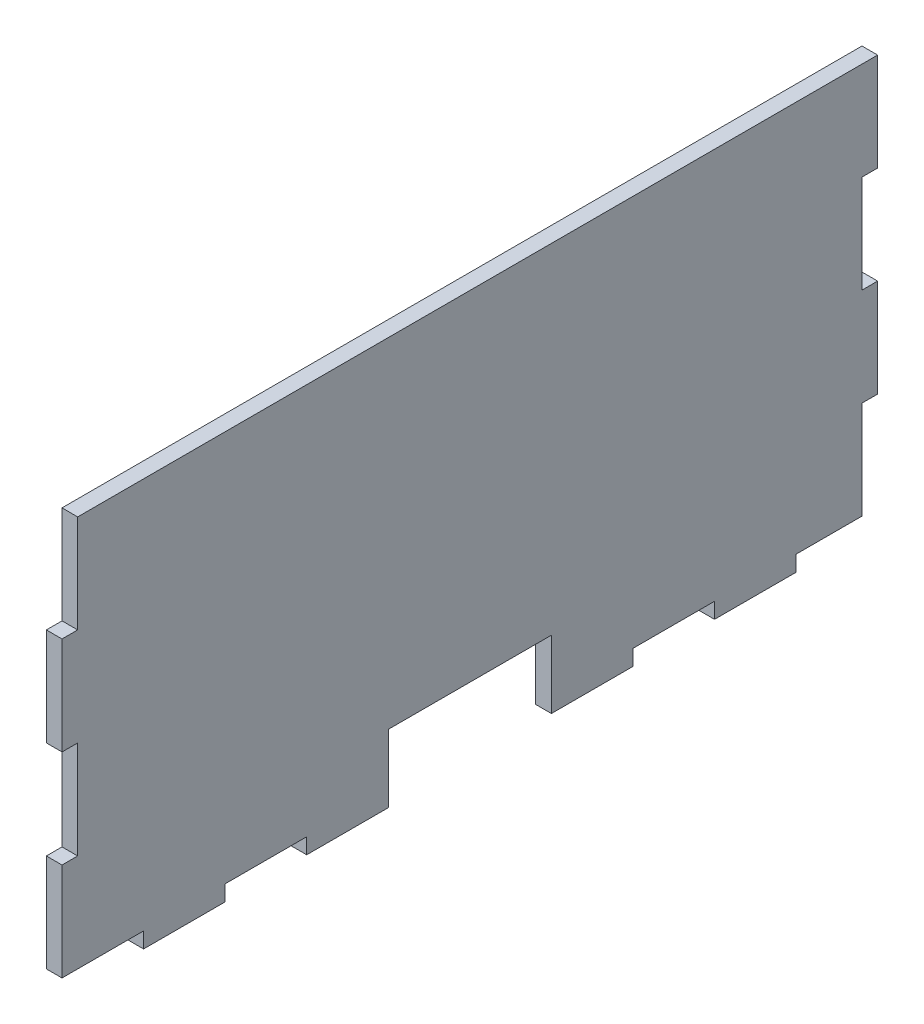
ISO-10303-21;
HEADER;
FILE_DESCRIPTION(('STEP AP214'),'2;1');
FILE_NAME('part.step','',(''),(''),'','','');
FILE_SCHEMA(('AUTOMOTIVE_DESIGN { 1 0 10303 214 1 1 1 1 }'));
ENDSEC;
DATA;
#1=APPLICATION_CONTEXT('core data for automotive mechanical design processes');
#2=APPLICATION_PROTOCOL_DEFINITION('international standard','automotive_design',2000,#1);
#3=PRODUCT_CONTEXT('',#1,'mechanical');
#4=PRODUCT('Part','Part','',(#3));
#5=PRODUCT_RELATED_PRODUCT_CATEGORY('part','',(#4));
#6=PRODUCT_DEFINITION_FORMATION('','',#4);
#7=PRODUCT_DEFINITION_CONTEXT('part definition',#1,'design');
#8=PRODUCT_DEFINITION('design','',#6,#7);
#9=PRODUCT_DEFINITION_SHAPE('','',#8);
#10=(LENGTH_UNIT() NAMED_UNIT(*) SI_UNIT(.MILLI.,.METRE.));
#11=(NAMED_UNIT(*) PLANE_ANGLE_UNIT() SI_UNIT($,.RADIAN.));
#12=(NAMED_UNIT(*) SI_UNIT($,.STERADIAN.) SOLID_ANGLE_UNIT());
#13=UNCERTAINTY_MEASURE_WITH_UNIT(LENGTH_MEASURE(1.E-05),#10,'distance_accuracy_value','');
#14=(GEOMETRIC_REPRESENTATION_CONTEXT(3) GLOBAL_UNCERTAINTY_ASSIGNED_CONTEXT((#13)) GLOBAL_UNIT_ASSIGNED_CONTEXT((#10,
#11,#12)) REPRESENTATION_CONTEXT('',''));
#15=CARTESIAN_POINT('',(0.,0.,0.));
#16=DIRECTION('',(0.,0.,1.));
#17=DIRECTION('',(1.,0.,0.));
#18=AXIS2_PLACEMENT_3D('',#15,#16,#17);
#19=CARTESIAN_POINT('',(3.048,79.248,-3.04799999999998));
#20=DIRECTION('',(0.,0.,-1.));
#21=DIRECTION('',(0.,1.,0.));
#22=AXIS2_PLACEMENT_3D('',#19,#20,#21);
#23=PLANE('',#22);
#24=DIRECTION('',(0.,-1.,0.));
#25=VECTOR('',#24,1.);
#26=CARTESIAN_POINT('',(0.,79.248,-3.04799999999998));
#27=LINE('',#26,#25);
#28=CARTESIAN_POINT('',(0.,79.248,-3.04799999999998));
#29=VERTEX_POINT('',#28);
#30=CARTESIAN_POINT('',(0.,60.198,-3.04799999999998));
#31=VERTEX_POINT('',#30);
#32=EDGE_CURVE('E272',#29,#31,#27,.T.);
#33=ORIENTED_EDGE('',*,*,#32,.T.);
#34=DIRECTION('',(-1.,0.,0.));
#35=VECTOR('',#34,1.);
#36=CARTESIAN_POINT('',(3.048,60.198,-3.04799999999998));
#37=LINE('',#36,#35);
#38=CARTESIAN_POINT('',(3.048,60.198,-3.04799999999998));
#39=VERTEX_POINT('',#38);
#40=EDGE_CURVE('E11',#39,#31,#37,.T.);
#41=ORIENTED_EDGE('',*,*,#40,.F.);
#42=DIRECTION('',(0.,-1.,0.));
#43=VECTOR('',#42,1.);
#44=CARTESIAN_POINT('',(3.048,79.248,-3.04799999999998));
#45=LINE('',#44,#43);
#46=CARTESIAN_POINT('',(3.048,79.248,-3.04799999999998));
#47=VERTEX_POINT('',#46);
#48=EDGE_CURVE('E336',#47,#39,#45,.T.);
#49=ORIENTED_EDGE('',*,*,#48,.F.);
#50=DIRECTION('',(-1.,0.,0.));
#51=VECTOR('',#50,1.);
#52=CARTESIAN_POINT('',(3.048,79.248,-3.04799999999998));
#53=LINE('',#52,#51);
#54=EDGE_CURVE('E268',#47,#29,#53,.T.);
#55=ORIENTED_EDGE('',*,*,#54,.T.);
#56=EDGE_LOOP('',(#33,#41,#49,#55));
#57=FACE_BOUND('',#56,.T.);
#58=ADVANCED_FACE('F32',(#57),#23,.F.);
#59=CARTESIAN_POINT('',(3.048,60.198,-3.04799999999998));
#60=DIRECTION('',(0.,-1.,0.));
#61=DIRECTION('',(0.,0.,-1.));
#62=AXIS2_PLACEMENT_3D('',#59,#60,#61);
#63=PLANE('',#62);
#64=DIRECTION('',(0.,0.,1.));
#65=VECTOR('',#64,1.);
#66=CARTESIAN_POINT('',(0.,60.198,-3.04799999999998));
#67=LINE('',#66,#65);
#68=CARTESIAN_POINT('',(0.,60.198,0.));
#69=VERTEX_POINT('',#68);
#70=EDGE_CURVE('E275',#31,#69,#67,.T.);
#71=ORIENTED_EDGE('',*,*,#70,.T.);
#72=DIRECTION('',(-1.,0.,0.));
#73=VECTOR('',#72,1.);
#74=CARTESIAN_POINT('',(3.048,60.198,0.));
#75=LINE('',#74,#73);
#76=CARTESIAN_POINT('',(3.048,60.198,0.));
#77=VERTEX_POINT('',#76);
#78=EDGE_CURVE('E40',#77,#69,#75,.T.);
#79=ORIENTED_EDGE('',*,*,#78,.F.);
#80=DIRECTION('',(0.,0.,1.));
#81=VECTOR('',#80,1.);
#82=CARTESIAN_POINT('',(3.048,60.198,-3.04799999999998));
#83=LINE('',#82,#81);
#84=EDGE_CURVE('E163',#39,#77,#83,.T.);
#85=ORIENTED_EDGE('',*,*,#84,.F.);
#86=ORIENTED_EDGE('',*,*,#40,.T.);
#87=EDGE_LOOP('',(#71,#79,#85,#86));
#88=FACE_BOUND('',#87,.T.);
#89=ADVANCED_FACE('F514',(#88),#63,.F.);
#90=CARTESIAN_POINT('',(3.048,60.198,0.));
#91=DIRECTION('',(0.,0.,-1.));
#92=DIRECTION('',(0.,1.,0.));
#93=AXIS2_PLACEMENT_3D('',#90,#91,#92);
#94=PLANE('',#93);
#95=DIRECTION('',(0.,-1.,0.));
#96=VECTOR('',#95,1.);
#97=CARTESIAN_POINT('',(0.,60.198,0.));
#98=LINE('',#97,#96);
#99=CARTESIAN_POINT('',(0.,41.148,0.));
#100=VERTEX_POINT('',#99);
#101=EDGE_CURVE('E277',#69,#100,#98,.T.);
#102=ORIENTED_EDGE('',*,*,#101,.T.);
#103=DIRECTION('',(-1.,0.,0.));
#104=VECTOR('',#103,1.);
#105=CARTESIAN_POINT('',(3.048,41.148,0.));
#106=LINE('',#105,#104);
#107=CARTESIAN_POINT('',(3.048,41.148,0.));
#108=VERTEX_POINT('',#107);
#109=EDGE_CURVE('E415',#108,#100,#106,.T.);
#110=ORIENTED_EDGE('',*,*,#109,.F.);
#111=DIRECTION('',(0.,-1.,0.));
#112=VECTOR('',#111,1.);
#113=CARTESIAN_POINT('',(3.048,60.198,0.));
#114=LINE('',#113,#112);
#115=EDGE_CURVE('E423',#77,#108,#114,.T.);
#116=ORIENTED_EDGE('',*,*,#115,.F.);
#117=ORIENTED_EDGE('',*,*,#78,.T.);
#118=EDGE_LOOP('',(#102,#110,#116,#117));
#119=FACE_BOUND('',#118,.T.);
#120=ADVANCED_FACE('F421',(#119),#94,.F.);
#121=CARTESIAN_POINT('',(3.048,41.148,0.));
#122=DIRECTION('',(0.,1.,0.));
#123=DIRECTION('',(0.,0.,1.));
#124=AXIS2_PLACEMENT_3D('',#121,#122,#123);
#125=PLANE('',#124);
#126=DIRECTION('',(0.,0.,-1.));
#127=VECTOR('',#126,1.);
#128=CARTESIAN_POINT('',(0.,41.148,0.));
#129=LINE('',#128,#127);
#130=CARTESIAN_POINT('',(0.,41.148,-3.04799999999999));
#131=VERTEX_POINT('',#130);
#132=EDGE_CURVE('E279',#100,#131,#129,.T.);
#133=ORIENTED_EDGE('',*,*,#132,.T.);
#134=DIRECTION('',(-1.,0.,0.));
#135=VECTOR('',#134,1.);
#136=CARTESIAN_POINT('',(3.048,41.148,-3.04799999999999));
#137=LINE('',#136,#135);
#138=CARTESIAN_POINT('',(3.048,41.148,-3.04799999999999));
#139=VERTEX_POINT('',#138);
#140=EDGE_CURVE('E412',#139,#131,#137,.T.);
#141=ORIENTED_EDGE('',*,*,#140,.F.);
#142=DIRECTION('',(0.,0.,-1.));
#143=VECTOR('',#142,1.);
#144=CARTESIAN_POINT('',(3.048,41.148,0.));
#145=LINE('',#144,#143);
#146=EDGE_CURVE('E441',#108,#139,#145,.T.);
#147=ORIENTED_EDGE('',*,*,#146,.F.);
#148=ORIENTED_EDGE('',*,*,#109,.T.);
#149=EDGE_LOOP('',(#133,#141,#147,#148));
#150=FACE_BOUND('',#149,.T.);
#151=ADVANCED_FACE('F432',(#150),#125,.F.);
#152=CARTESIAN_POINT('',(3.048,41.148,-3.04799999999999));
#153=DIRECTION('',(0.,0.,-1.));
#154=DIRECTION('',(0.,1.,0.));
#155=AXIS2_PLACEMENT_3D('',#152,#153,#154);
#156=PLANE('',#155);
#157=DIRECTION('',(0.,-1.,0.));
#158=VECTOR('',#157,1.);
#159=CARTESIAN_POINT('',(0.,41.148,-3.04799999999999));
#160=LINE('',#159,#158);
#161=CARTESIAN_POINT('',(0.,22.098,-3.04799999999999));
#162=VERTEX_POINT('',#161);
#163=EDGE_CURVE('E281',#131,#162,#160,.T.);
#164=ORIENTED_EDGE('',*,*,#163,.T.);
#165=DIRECTION('',(-1.,0.,0.));
#166=VECTOR('',#165,1.);
#167=CARTESIAN_POINT('',(3.048,22.098,-3.04799999999999));
#168=LINE('',#167,#166);
#169=CARTESIAN_POINT('',(3.048,22.098,-3.04799999999999));
#170=VERTEX_POINT('',#169);
#171=EDGE_CURVE('E409',#170,#162,#168,.T.);
#172=ORIENTED_EDGE('',*,*,#171,.F.);
#173=DIRECTION('',(0.,-1.,0.));
#174=VECTOR('',#173,1.);
#175=CARTESIAN_POINT('',(3.048,41.148,-3.04799999999999));
#176=LINE('',#175,#174);
#177=EDGE_CURVE('E438',#139,#170,#176,.T.);
#178=ORIENTED_EDGE('',*,*,#177,.F.);
#179=ORIENTED_EDGE('',*,*,#140,.T.);
#180=EDGE_LOOP('',(#164,#172,#178,#179));
#181=FACE_BOUND('',#180,.T.);
#182=ADVANCED_FACE('F436',(#181),#156,.F.);
#183=CARTESIAN_POINT('',(3.048,22.098,-3.04799999999999));
#184=DIRECTION('',(0.,-1.,0.));
#185=DIRECTION('',(0.,0.,-1.));
#186=AXIS2_PLACEMENT_3D('',#183,#184,#185);
#187=PLANE('',#186);
#188=DIRECTION('',(0.,0.,1.));
#189=VECTOR('',#188,1.);
#190=CARTESIAN_POINT('',(0.,22.098,-3.04799999999999));
#191=LINE('',#190,#189);
#192=CARTESIAN_POINT('',(0.,22.098,0.));
#193=VERTEX_POINT('',#192);
#194=EDGE_CURVE('E283',#162,#193,#191,.T.);
#195=ORIENTED_EDGE('',*,*,#194,.T.);
#196=DIRECTION('',(-1.,0.,0.));
#197=VECTOR('',#196,1.);
#198=CARTESIAN_POINT('',(3.048,22.098,0.));
#199=LINE('',#198,#197);
#200=CARTESIAN_POINT('',(3.048,22.098,0.));
#201=VERTEX_POINT('',#200);
#202=EDGE_CURVE('E406',#201,#193,#199,.T.);
#203=ORIENTED_EDGE('',*,*,#202,.F.);
#204=DIRECTION('',(0.,0.,1.));
#205=VECTOR('',#204,1.);
#206=CARTESIAN_POINT('',(3.048,22.098,-3.04799999999999));
#207=LINE('',#206,#205);
#208=EDGE_CURVE('E440',#170,#201,#207,.T.);
#209=ORIENTED_EDGE('',*,*,#208,.F.);
#210=ORIENTED_EDGE('',*,*,#171,.T.);
#211=EDGE_LOOP('',(#195,#203,#209,#210));
#212=FACE_BOUND('',#211,.T.);
#213=ADVANCED_FACE('F527',(#212),#187,.F.);
#214=CARTESIAN_POINT('',(3.048,22.098,0.));
#215=DIRECTION('',(0.,0.,-1.));
#216=DIRECTION('',(0.,1.,0.));
#217=AXIS2_PLACEMENT_3D('',#214,#215,#216);
#218=PLANE('',#217);
#219=DIRECTION('',(0.,-1.,0.));
#220=VECTOR('',#219,1.);
#221=CARTESIAN_POINT('',(0.,22.098,0.));
#222=LINE('',#221,#220);
#223=CARTESIAN_POINT('',(0.,3.048,0.));
#224=VERTEX_POINT('',#223);
#225=EDGE_CURVE('E285',#193,#224,#222,.T.);
#226=ORIENTED_EDGE('',*,*,#225,.T.);
#227=DIRECTION('',(-1.,0.,0.));
#228=VECTOR('',#227,1.);
#229=CARTESIAN_POINT('',(3.048,3.048,0.));
#230=LINE('',#229,#228);
#231=CARTESIAN_POINT('',(3.048,3.048,0.));
#232=VERTEX_POINT('',#231);
#233=EDGE_CURVE('E403',#232,#224,#230,.T.);
#234=ORIENTED_EDGE('',*,*,#233,.F.);
#235=DIRECTION('',(0.,-1.,0.));
#236=VECTOR('',#235,1.);
#237=CARTESIAN_POINT('',(3.048,22.098,0.));
#238=LINE('',#237,#236);
#239=EDGE_CURVE('E443',#201,#232,#238,.T.);
#240=ORIENTED_EDGE('',*,*,#239,.F.);
#241=ORIENTED_EDGE('',*,*,#202,.T.);
#242=EDGE_LOOP('',(#226,#234,#240,#241));
#243=FACE_BOUND('',#242,.T.);
#244=ADVANCED_FACE('F530',(#243),#218,.F.);
#245=CARTESIAN_POINT('',(3.048,3.048,0.));
#246=DIRECTION('',(0.,1.,0.));
#247=DIRECTION('',(0.,0.,1.));
#248=AXIS2_PLACEMENT_3D('',#245,#246,#247);
#249=PLANE('',#248);
#250=DIRECTION('',(0.,0.,-1.));
#251=VECTOR('',#250,1.);
#252=CARTESIAN_POINT('',(0.,3.048,0.));
#253=LINE('',#252,#251);
#254=CARTESIAN_POINT('',(0.,3.048,-15.875));
#255=VERTEX_POINT('',#254);
#256=EDGE_CURVE('E287',#224,#255,#253,.T.);
#257=ORIENTED_EDGE('',*,*,#256,.T.);
#258=DIRECTION('',(-1.,0.,0.));
#259=VECTOR('',#258,1.);
#260=CARTESIAN_POINT('',(3.048,3.048,-15.875));
#261=LINE('',#260,#259);
#262=CARTESIAN_POINT('',(3.048,3.048,-15.875));
#263=VERTEX_POINT('',#262);
#264=EDGE_CURVE('E400',#263,#255,#261,.T.);
#265=ORIENTED_EDGE('',*,*,#264,.F.);
#266=DIRECTION('',(0.,0.,-1.));
#267=VECTOR('',#266,1.);
#268=CARTESIAN_POINT('',(3.048,3.048,0.));
#269=LINE('',#268,#267);
#270=EDGE_CURVE('E449',#232,#263,#269,.T.);
#271=ORIENTED_EDGE('',*,*,#270,.F.);
#272=ORIENTED_EDGE('',*,*,#233,.T.);
#273=EDGE_LOOP('',(#257,#265,#271,#272));
#274=FACE_BOUND('',#273,.T.);
#275=ADVANCED_FACE('F534',(#274),#249,.F.);
#276=CARTESIAN_POINT('',(3.048,3.048,-15.875));
#277=DIRECTION('',(0.,0.,-1.));
#278=DIRECTION('',(0.,1.,0.));
#279=AXIS2_PLACEMENT_3D('',#276,#277,#278);
#280=PLANE('',#279);
#281=DIRECTION('',(0.,-1.,0.));
#282=VECTOR('',#281,1.);
#283=CARTESIAN_POINT('',(0.,3.048,-15.875));
#284=LINE('',#283,#282);
#285=CARTESIAN_POINT('',(0.,0.,-15.875));
#286=VERTEX_POINT('',#285);
#287=EDGE_CURVE('E289',#255,#286,#284,.T.);
#288=ORIENTED_EDGE('',*,*,#287,.T.);
#289=DIRECTION('',(-1.,0.,0.));
#290=VECTOR('',#289,1.);
#291=CARTESIAN_POINT('',(3.048,0.,-15.875));
#292=LINE('',#291,#290);
#293=CARTESIAN_POINT('',(3.048,0.,-15.875));
#294=VERTEX_POINT('',#293);
#295=EDGE_CURVE('E397',#294,#286,#292,.T.);
#296=ORIENTED_EDGE('',*,*,#295,.F.);
#297=DIRECTION('',(0.,-1.,0.));
#298=VECTOR('',#297,1.);
#299=CARTESIAN_POINT('',(3.048,3.048,-15.875));
#300=LINE('',#299,#298);
#301=EDGE_CURVE('E451',#263,#294,#300,.T.);
#302=ORIENTED_EDGE('',*,*,#301,.F.);
#303=ORIENTED_EDGE('',*,*,#264,.T.);
#304=EDGE_LOOP('',(#288,#296,#302,#303));
#305=FACE_BOUND('',#304,.T.);
#306=ADVANCED_FACE('F538',(#305),#280,.F.);
#307=CARTESIAN_POINT('',(3.048,0.,-15.875));
#308=DIRECTION('',(0.,1.,0.));
#309=DIRECTION('',(0.,0.,1.));
#310=AXIS2_PLACEMENT_3D('',#307,#308,#309);
#311=PLANE('',#310);
#312=DIRECTION('',(0.,0.,-1.));
#313=VECTOR('',#312,1.);
#314=CARTESIAN_POINT('',(0.,0.,-15.875));
#315=LINE('',#314,#313);
#316=CARTESIAN_POINT('',(0.,0.,-31.75));
#317=VERTEX_POINT('',#316);
#318=EDGE_CURVE('E291',#286,#317,#315,.T.);
#319=ORIENTED_EDGE('',*,*,#318,.T.);
#320=DIRECTION('',(-1.,0.,0.));
#321=VECTOR('',#320,1.);
#322=CARTESIAN_POINT('',(3.048,0.,-31.75));
#323=LINE('',#322,#321);
#324=CARTESIAN_POINT('',(3.048,0.,-31.75));
#325=VERTEX_POINT('',#324);
#326=EDGE_CURVE('E394',#325,#317,#323,.T.);
#327=ORIENTED_EDGE('',*,*,#326,.F.);
#328=DIRECTION('',(0.,0.,-1.));
#329=VECTOR('',#328,1.);
#330=CARTESIAN_POINT('',(3.048,0.,-15.875));
#331=LINE('',#330,#329);
#332=EDGE_CURVE('E453',#294,#325,#331,.T.);
#333=ORIENTED_EDGE('',*,*,#332,.F.);
#334=ORIENTED_EDGE('',*,*,#295,.T.);
#335=EDGE_LOOP('',(#319,#327,#333,#334));
#336=FACE_BOUND('',#335,.T.);
#337=ADVANCED_FACE('F542',(#336),#311,.F.);
#338=CARTESIAN_POINT('',(3.048,0.,-31.75));
#339=DIRECTION('',(0.,0.,1.));
#340=DIRECTION('',(1.,0.,0.));
#341=AXIS2_PLACEMENT_3D('',#338,#339,#340);
#342=PLANE('',#341);
#343=DIRECTION('',(0.,1.,0.));
#344=VECTOR('',#343,1.);
#345=CARTESIAN_POINT('',(0.,0.,-31.75));
#346=LINE('',#345,#344);
#347=CARTESIAN_POINT('',(0.,3.048,-31.75));
#348=VERTEX_POINT('',#347);
#349=EDGE_CURVE('E293',#317,#348,#346,.T.);
#350=ORIENTED_EDGE('',*,*,#349,.T.);
#351=DIRECTION('',(-1.,0.,0.));
#352=VECTOR('',#351,1.);
#353=CARTESIAN_POINT('',(3.048,3.048,-31.75));
#354=LINE('',#353,#352);
#355=CARTESIAN_POINT('',(3.048,3.048,-31.75));
#356=VERTEX_POINT('',#355);
#357=EDGE_CURVE('E391',#356,#348,#354,.T.);
#358=ORIENTED_EDGE('',*,*,#357,.F.);
#359=DIRECTION('',(0.,1.,0.));
#360=VECTOR('',#359,1.);
#361=CARTESIAN_POINT('',(3.048,0.,-31.75));
#362=LINE('',#361,#360);
#363=EDGE_CURVE('E455',#325,#356,#362,.T.);
#364=ORIENTED_EDGE('',*,*,#363,.F.);
#365=ORIENTED_EDGE('',*,*,#326,.T.);
#366=EDGE_LOOP('',(#350,#358,#364,#365));
#367=FACE_BOUND('',#366,.T.);
#368=ADVANCED_FACE('F546',(#367),#342,.F.);
#369=CARTESIAN_POINT('',(3.048,3.048,-31.75));
#370=DIRECTION('',(0.,1.,0.));
#371=DIRECTION('',(0.,0.,1.));
#372=AXIS2_PLACEMENT_3D('',#369,#370,#371);
#373=PLANE('',#372);
#374=DIRECTION('',(0.,0.,-1.));
#375=VECTOR('',#374,1.);
#376=CARTESIAN_POINT('',(0.,3.048,-31.75));
#377=LINE('',#376,#375);
#378=CARTESIAN_POINT('',(0.,3.048,-47.625));
#379=VERTEX_POINT('',#378);
#380=EDGE_CURVE('E295',#348,#379,#377,.T.);
#381=ORIENTED_EDGE('',*,*,#380,.T.);
#382=DIRECTION('',(-1.,0.,0.));
#383=VECTOR('',#382,1.);
#384=CARTESIAN_POINT('',(3.048,3.048,-47.625));
#385=LINE('',#384,#383);
#386=CARTESIAN_POINT('',(3.048,3.048,-47.625));
#387=VERTEX_POINT('',#386);
#388=EDGE_CURVE('E388',#387,#379,#385,.T.);
#389=ORIENTED_EDGE('',*,*,#388,.F.);
#390=DIRECTION('',(0.,0.,-1.));
#391=VECTOR('',#390,1.);
#392=CARTESIAN_POINT('',(3.048,3.048,-31.75));
#393=LINE('',#392,#391);
#394=EDGE_CURVE('E457',#356,#387,#393,.T.);
#395=ORIENTED_EDGE('',*,*,#394,.F.);
#396=ORIENTED_EDGE('',*,*,#357,.T.);
#397=EDGE_LOOP('',(#381,#389,#395,#396));
#398=FACE_BOUND('',#397,.T.);
#399=ADVANCED_FACE('F550',(#398),#373,.F.);
#400=CARTESIAN_POINT('',(3.048,3.048,-47.625));
#401=DIRECTION('',(0.,0.,-1.));
#402=DIRECTION('',(-1.,0.,0.));
#403=AXIS2_PLACEMENT_3D('',#400,#401,#402);
#404=PLANE('',#403);
#405=DIRECTION('',(0.,-1.,0.));
#406=VECTOR('',#405,1.);
#407=CARTESIAN_POINT('',(0.,3.048,-47.625));
#408=LINE('',#407,#406);
#409=CARTESIAN_POINT('',(0.,0.,-47.625));
#410=VERTEX_POINT('',#409);
#411=EDGE_CURVE('E297',#379,#410,#408,.T.);
#412=ORIENTED_EDGE('',*,*,#411,.T.);
#413=DIRECTION('',(-1.,0.,0.));
#414=VECTOR('',#413,1.);
#415=CARTESIAN_POINT('',(3.048,0.,-47.625));
#416=LINE('',#415,#414);
#417=CARTESIAN_POINT('',(3.048,0.,-47.625));
#418=VERTEX_POINT('',#417);
#419=EDGE_CURVE('E385',#418,#410,#416,.T.);
#420=ORIENTED_EDGE('',*,*,#419,.F.);
#421=DIRECTION('',(0.,-1.,0.));
#422=VECTOR('',#421,1.);
#423=CARTESIAN_POINT('',(3.048,3.048,-47.625));
#424=LINE('',#423,#422);
#425=EDGE_CURVE('E459',#387,#418,#424,.T.);
#426=ORIENTED_EDGE('',*,*,#425,.F.);
#427=ORIENTED_EDGE('',*,*,#388,.T.);
#428=EDGE_LOOP('',(#412,#420,#426,#427));
#429=FACE_BOUND('',#428,.T.);
#430=ADVANCED_FACE('F554',(#429),#404,.F.);
#431=CARTESIAN_POINT('',(3.048,0.,-47.625));
#432=DIRECTION('',(0.,1.,0.));
#433=DIRECTION('',(0.,0.,1.));
#434=AXIS2_PLACEMENT_3D('',#431,#432,#433);
#435=PLANE('',#434);
#436=DIRECTION('',(0.,0.,-1.));
#437=VECTOR('',#436,1.);
#438=CARTESIAN_POINT('',(0.,0.,-47.625));
#439=LINE('',#438,#437);
#440=CARTESIAN_POINT('',(0.,0.,-63.5));
#441=VERTEX_POINT('',#440);
#442=EDGE_CURVE('E299',#410,#441,#439,.T.);
#443=ORIENTED_EDGE('',*,*,#442,.T.);
#444=DIRECTION('',(-1.,0.,0.));
#445=VECTOR('',#444,1.);
#446=CARTESIAN_POINT('',(3.048,0.,-63.5));
#447=LINE('',#446,#445);
#448=CARTESIAN_POINT('',(3.048,0.,-63.5));
#449=VERTEX_POINT('',#448);
#450=EDGE_CURVE('E382',#449,#441,#447,.T.);
#451=ORIENTED_EDGE('',*,*,#450,.F.);
#452=DIRECTION('',(0.,0.,-1.));
#453=VECTOR('',#452,1.);
#454=CARTESIAN_POINT('',(3.048,0.,-47.625));
#455=LINE('',#454,#453);
#456=EDGE_CURVE('E461',#418,#449,#455,.T.);
#457=ORIENTED_EDGE('',*,*,#456,.F.);
#458=ORIENTED_EDGE('',*,*,#419,.T.);
#459=EDGE_LOOP('',(#443,#451,#457,#458));
#460=FACE_BOUND('',#459,.T.);
#461=ADVANCED_FACE('F558',(#460),#435,.F.);
#462=CARTESIAN_POINT('',(3.048,13.208,-63.5));
#463=DIRECTION('',(0.,0.,1.));
#464=DIRECTION('',(1.,0.,0.));
#465=AXIS2_PLACEMENT_3D('',#462,#463,#464);
#466=PLANE('',#465);
#467=DIRECTION('',(0.,1.,0.));
#468=VECTOR('',#467,1.);
#469=CARTESIAN_POINT('',(0.,13.208,-63.5));
#470=LINE('',#469,#468);
#471=CARTESIAN_POINT('',(0.,13.208,-63.5));
#472=VERTEX_POINT('',#471);
#473=EDGE_CURVE('E302',#441,#472,#470,.T.);
#474=ORIENTED_EDGE('',*,*,#473,.T.);
#475=DIRECTION('',(-1.,0.,0.));
#476=VECTOR('',#475,1.);
#477=CARTESIAN_POINT('',(3.048,13.208,-63.5));
#478=LINE('',#477,#476);
#479=CARTESIAN_POINT('',(3.048,13.208,-63.5));
#480=VERTEX_POINT('',#479);
#481=EDGE_CURVE('E379',#480,#472,#478,.T.);
#482=ORIENTED_EDGE('',*,*,#481,.F.);
#483=DIRECTION('',(0.,1.,0.));
#484=VECTOR('',#483,1.);
#485=CARTESIAN_POINT('',(3.048,0.,-63.5));
#486=LINE('',#485,#484);
#487=EDGE_CURVE('E463',#449,#480,#486,.T.);
#488=ORIENTED_EDGE('',*,*,#487,.F.);
#489=ORIENTED_EDGE('',*,*,#450,.T.);
#490=EDGE_LOOP('',(#474,#482,#488,#489));
#491=FACE_BOUND('',#490,.T.);
#492=ADVANCED_FACE('F562',(#491),#466,.F.);
#493=CARTESIAN_POINT('',(3.048,13.208,-95.25));
#494=DIRECTION('',(0.,1.,0.));
#495=DIRECTION('',(0.,0.,1.));
#496=AXIS2_PLACEMENT_3D('',#493,#494,#495);
#497=PLANE('',#496);
#498=DIRECTION('',(0.,0.,-1.));
#499=VECTOR('',#498,1.);
#500=CARTESIAN_POINT('',(0.,13.208,-95.25));
#501=LINE('',#500,#499);
#502=CARTESIAN_POINT('',(0.,13.208,-95.25));
#503=VERTEX_POINT('',#502);
#504=EDGE_CURVE('E304',#472,#503,#501,.T.);
#505=ORIENTED_EDGE('',*,*,#504,.T.);
#506=DIRECTION('',(-1.,0.,0.));
#507=VECTOR('',#506,1.);
#508=CARTESIAN_POINT('',(3.048,13.208,-95.25));
#509=LINE('',#508,#507);
#510=CARTESIAN_POINT('',(3.048,13.208,-95.25));
#511=VERTEX_POINT('',#510);
#512=EDGE_CURVE('E376',#511,#503,#509,.T.);
#513=ORIENTED_EDGE('',*,*,#512,.F.);
#514=DIRECTION('',(0.,0.,-1.));
#515=VECTOR('',#514,1.);
#516=CARTESIAN_POINT('',(3.048,13.208,-95.25));
#517=LINE('',#516,#515);
#518=EDGE_CURVE('E465',#480,#511,#517,.T.);
#519=ORIENTED_EDGE('',*,*,#518,.F.);
#520=ORIENTED_EDGE('',*,*,#481,.T.);
#521=EDGE_LOOP('',(#505,#513,#519,#520));
#522=FACE_BOUND('',#521,.T.);
#523=ADVANCED_FACE('F566',(#522),#497,.F.);
#524=CARTESIAN_POINT('',(3.048,0.,-95.2499999999999));
#525=DIRECTION('',(0.,0.,-1.));
#526=DIRECTION('',(0.,1.,0.));
#527=AXIS2_PLACEMENT_3D('',#524,#525,#526);
#528=PLANE('',#527);
#529=DIRECTION('',(0.,-1.,0.));
#530=VECTOR('',#529,1.);
#531=CARTESIAN_POINT('',(0.,0.,-95.2499999999999));
#532=LINE('',#531,#530);
#533=CARTESIAN_POINT('',(0.,0.,-95.2499999999999));
#534=VERTEX_POINT('',#533);
#535=EDGE_CURVE('E307',#503,#534,#532,.T.);
#536=ORIENTED_EDGE('',*,*,#535,.T.);
#537=DIRECTION('',(-1.,0.,0.));
#538=VECTOR('',#537,1.);
#539=CARTESIAN_POINT('',(3.048,0.,-95.2499999999999));
#540=LINE('',#539,#538);
#541=CARTESIAN_POINT('',(3.048,0.,-95.2499999999999));
#542=VERTEX_POINT('',#541);
#543=EDGE_CURVE('E373',#542,#534,#540,.T.);
#544=ORIENTED_EDGE('',*,*,#543,.F.);
#545=DIRECTION('',(0.,-1.,0.));
#546=VECTOR('',#545,1.);
#547=CARTESIAN_POINT('',(3.048,3.04800000000001,-95.25));
#548=LINE('',#547,#546);
#549=EDGE_CURVE('E467',#511,#542,#548,.T.);
#550=ORIENTED_EDGE('',*,*,#549,.F.);
#551=ORIENTED_EDGE('',*,*,#512,.T.);
#552=EDGE_LOOP('',(#536,#544,#550,#551));
#553=FACE_BOUND('',#552,.T.);
#554=ADVANCED_FACE('F570',(#553),#528,.F.);
#555=CARTESIAN_POINT('',(3.048,0.,-111.125));
#556=DIRECTION('',(0.,1.,0.));
#557=DIRECTION('',(0.,0.,1.));
#558=AXIS2_PLACEMENT_3D('',#555,#556,#557);
#559=PLANE('',#558);
#560=DIRECTION('',(0.,0.,-1.));
#561=VECTOR('',#560,1.);
#562=CARTESIAN_POINT('',(0.,0.,-111.125));
#563=LINE('',#562,#561);
#564=CARTESIAN_POINT('',(0.,0.,-111.125));
#565=VERTEX_POINT('',#564);
#566=EDGE_CURVE('E309',#534,#565,#563,.T.);
#567=ORIENTED_EDGE('',*,*,#566,.T.);
#568=DIRECTION('',(-1.,0.,0.));
#569=VECTOR('',#568,1.);
#570=CARTESIAN_POINT('',(3.048,0.,-111.125));
#571=LINE('',#570,#569);
#572=CARTESIAN_POINT('',(3.048,0.,-111.125));
#573=VERTEX_POINT('',#572);
#574=EDGE_CURVE('E370',#573,#565,#571,.T.);
#575=ORIENTED_EDGE('',*,*,#574,.F.);
#576=DIRECTION('',(0.,0.,-1.));
#577=VECTOR('',#576,1.);
#578=CARTESIAN_POINT('',(3.048,0.,-111.125));
#579=LINE('',#578,#577);
#580=EDGE_CURVE('E469',#542,#573,#579,.T.);
#581=ORIENTED_EDGE('',*,*,#580,.F.);
#582=ORIENTED_EDGE('',*,*,#543,.T.);
#583=EDGE_LOOP('',(#567,#575,#581,#582));
#584=FACE_BOUND('',#583,.T.);
#585=ADVANCED_FACE('F574',(#584),#559,.F.);
#586=CARTESIAN_POINT('',(3.048,3.04800000000001,-111.125));
#587=DIRECTION('',(0.,0.,1.));
#588=DIRECTION('',(1.,0.,0.));
#589=AXIS2_PLACEMENT_3D('',#586,#587,#588);
#590=PLANE('',#589);
#591=DIRECTION('',(0.,1.,0.));
#592=VECTOR('',#591,1.);
#593=CARTESIAN_POINT('',(0.,3.04800000000001,-111.125));
#594=LINE('',#593,#592);
#595=CARTESIAN_POINT('',(0.,3.04800000000001,-111.125));
#596=VERTEX_POINT('',#595);
#597=EDGE_CURVE('E311',#565,#596,#594,.T.);
#598=ORIENTED_EDGE('',*,*,#597,.T.);
#599=DIRECTION('',(-1.,0.,0.));
#600=VECTOR('',#599,1.);
#601=CARTESIAN_POINT('',(3.048,3.04800000000001,-111.125));
#602=LINE('',#601,#600);
#603=CARTESIAN_POINT('',(3.048,3.04800000000001,-111.125));
#604=VERTEX_POINT('',#603);
#605=EDGE_CURVE('E367',#604,#596,#602,.T.);
#606=ORIENTED_EDGE('',*,*,#605,.F.);
#607=DIRECTION('',(0.,1.,0.));
#608=VECTOR('',#607,1.);
#609=CARTESIAN_POINT('',(3.048,3.04800000000001,-111.125));
#610=LINE('',#609,#608);
#611=EDGE_CURVE('E471',#573,#604,#610,.T.);
#612=ORIENTED_EDGE('',*,*,#611,.F.);
#613=ORIENTED_EDGE('',*,*,#574,.T.);
#614=EDGE_LOOP('',(#598,#606,#612,#613));
#615=FACE_BOUND('',#614,.T.);
#616=ADVANCED_FACE('F578',(#615),#590,.F.);
#617=CARTESIAN_POINT('',(3.048,3.04800000000001,-111.125));
#618=DIRECTION('',(0.,1.,0.));
#619=DIRECTION('',(0.,0.,1.));
#620=AXIS2_PLACEMENT_3D('',#617,#618,#619);
#621=PLANE('',#620);
#622=DIRECTION('',(0.,0.,-1.));
#623=VECTOR('',#622,1.);
#624=CARTESIAN_POINT('',(0.,3.04800000000001,-111.125));
#625=LINE('',#624,#623);
#626=CARTESIAN_POINT('',(0.,3.04800000000001,-127.));
#627=VERTEX_POINT('',#626);
#628=EDGE_CURVE('E313',#596,#627,#625,.T.);
#629=ORIENTED_EDGE('',*,*,#628,.T.);
#630=DIRECTION('',(-1.,0.,0.));
#631=VECTOR('',#630,1.);
#632=CARTESIAN_POINT('',(3.048,3.04800000000001,-127.));
#633=LINE('',#632,#631);
#634=CARTESIAN_POINT('',(3.048,3.04800000000001,-127.));
#635=VERTEX_POINT('',#634);
#636=EDGE_CURVE('E364',#635,#627,#633,.T.);
#637=ORIENTED_EDGE('',*,*,#636,.F.);
#638=DIRECTION('',(0.,0.,-1.));
#639=VECTOR('',#638,1.);
#640=CARTESIAN_POINT('',(3.048,3.04800000000001,-111.125));
#641=LINE('',#640,#639);
#642=EDGE_CURVE('E473',#604,#635,#641,.T.);
#643=ORIENTED_EDGE('',*,*,#642,.F.);
#644=ORIENTED_EDGE('',*,*,#605,.T.);
#645=EDGE_LOOP('',(#629,#637,#643,#644));
#646=FACE_BOUND('',#645,.T.);
#647=ADVANCED_FACE('F582',(#646),#621,.F.);
#648=CARTESIAN_POINT('',(3.048,0.,-127.));
#649=DIRECTION('',(0.,0.,-1.));
#650=DIRECTION('',(-1.,0.,0.));
#651=AXIS2_PLACEMENT_3D('',#648,#649,#650);
#652=PLANE('',#651);
#653=DIRECTION('',(0.,-1.,0.));
#654=VECTOR('',#653,1.);
#655=CARTESIAN_POINT('',(0.,0.,-127.));
#656=LINE('',#655,#654);
#657=CARTESIAN_POINT('',(0.,0.,-127.));
#658=VERTEX_POINT('',#657);
#659=EDGE_CURVE('E315',#627,#658,#656,.T.);
#660=ORIENTED_EDGE('',*,*,#659,.T.);
#661=DIRECTION('',(-1.,0.,0.));
#662=VECTOR('',#661,1.);
#663=CARTESIAN_POINT('',(3.048,0.,-127.));
#664=LINE('',#663,#662);
#665=CARTESIAN_POINT('',(3.048,0.,-127.));
#666=VERTEX_POINT('',#665);
#667=EDGE_CURVE('E361',#666,#658,#664,.T.);
#668=ORIENTED_EDGE('',*,*,#667,.F.);
#669=DIRECTION('',(0.,-1.,0.));
#670=VECTOR('',#669,1.);
#671=CARTESIAN_POINT('',(3.048,0.,-127.));
#672=LINE('',#671,#670);
#673=EDGE_CURVE('E475',#635,#666,#672,.T.);
#674=ORIENTED_EDGE('',*,*,#673,.F.);
#675=ORIENTED_EDGE('',*,*,#636,.T.);
#676=EDGE_LOOP('',(#660,#668,#674,#675));
#677=FACE_BOUND('',#676,.T.);
#678=ADVANCED_FACE('F586',(#677),#652,.F.);
#679=CARTESIAN_POINT('',(3.048,0.,-142.875));
#680=DIRECTION('',(0.,1.,0.));
#681=DIRECTION('',(0.,0.,1.));
#682=AXIS2_PLACEMENT_3D('',#679,#680,#681);
#683=PLANE('',#682);
#684=DIRECTION('',(0.,0.,-1.));
#685=VECTOR('',#684,1.);
#686=CARTESIAN_POINT('',(0.,0.,-142.875));
#687=LINE('',#686,#685);
#688=CARTESIAN_POINT('',(0.,0.,-142.875));
#689=VERTEX_POINT('',#688);
#690=EDGE_CURVE('E317',#658,#689,#687,.T.);
#691=ORIENTED_EDGE('',*,*,#690,.T.);
#692=DIRECTION('',(-1.,0.,0.));
#693=VECTOR('',#692,1.);
#694=CARTESIAN_POINT('',(3.048,0.,-142.875));
#695=LINE('',#694,#693);
#696=CARTESIAN_POINT('',(3.048,0.,-142.875));
#697=VERTEX_POINT('',#696);
#698=EDGE_CURVE('E358',#697,#689,#695,.T.);
#699=ORIENTED_EDGE('',*,*,#698,.F.);
#700=DIRECTION('',(0.,0.,-1.));
#701=VECTOR('',#700,1.);
#702=CARTESIAN_POINT('',(3.048,0.,-142.875));
#703=LINE('',#702,#701);
#704=EDGE_CURVE('E477',#666,#697,#703,.T.);
#705=ORIENTED_EDGE('',*,*,#704,.F.);
#706=ORIENTED_EDGE('',*,*,#667,.T.);
#707=EDGE_LOOP('',(#691,#699,#705,#706));
#708=FACE_BOUND('',#707,.T.);
#709=ADVANCED_FACE('F590',(#708),#683,.F.);
#710=CARTESIAN_POINT('',(3.048,3.04800000000001,-142.875));
#711=DIRECTION('',(0.,0.,1.));
#712=DIRECTION('',(1.,0.,0.));
#713=AXIS2_PLACEMENT_3D('',#710,#711,#712);
#714=PLANE('',#713);
#715=DIRECTION('',(0.,1.,0.));
#716=VECTOR('',#715,1.);
#717=CARTESIAN_POINT('',(0.,3.04800000000001,-142.875));
#718=LINE('',#717,#716);
#719=CARTESIAN_POINT('',(0.,3.04800000000001,-142.875));
#720=VERTEX_POINT('',#719);
#721=EDGE_CURVE('E319',#689,#720,#718,.T.);
#722=ORIENTED_EDGE('',*,*,#721,.T.);
#723=DIRECTION('',(-1.,0.,0.));
#724=VECTOR('',#723,1.);
#725=CARTESIAN_POINT('',(3.048,3.04800000000001,-142.875));
#726=LINE('',#725,#724);
#727=CARTESIAN_POINT('',(3.048,3.04800000000001,-142.875));
#728=VERTEX_POINT('',#727);
#729=EDGE_CURVE('E355',#728,#720,#726,.T.);
#730=ORIENTED_EDGE('',*,*,#729,.F.);
#731=DIRECTION('',(0.,1.,0.));
#732=VECTOR('',#731,1.);
#733=CARTESIAN_POINT('',(3.048,3.04800000000001,-142.875));
#734=LINE('',#733,#732);
#735=EDGE_CURVE('E479',#697,#728,#734,.T.);
#736=ORIENTED_EDGE('',*,*,#735,.F.);
#737=ORIENTED_EDGE('',*,*,#698,.T.);
#738=EDGE_LOOP('',(#722,#730,#736,#737));
#739=FACE_BOUND('',#738,.T.);
#740=ADVANCED_FACE('F594',(#739),#714,.F.);
#741=CARTESIAN_POINT('',(3.048,3.04800000000001,-142.875));
#742=DIRECTION('',(0.,1.,0.));
#743=DIRECTION('',(0.,0.,1.));
#744=AXIS2_PLACEMENT_3D('',#741,#742,#743);
#745=PLANE('',#744);
#746=DIRECTION('',(0.,0.,-1.));
#747=VECTOR('',#746,1.);
#748=CARTESIAN_POINT('',(0.,3.04800000000001,-142.875));
#749=LINE('',#748,#747);
#750=CARTESIAN_POINT('',(0.,3.04800000000001,-155.702));
#751=VERTEX_POINT('',#750);
#752=EDGE_CURVE('E321',#720,#751,#749,.T.);
#753=ORIENTED_EDGE('',*,*,#752,.T.);
#754=DIRECTION('',(-1.,0.,0.));
#755=VECTOR('',#754,1.);
#756=CARTESIAN_POINT('',(3.048,3.04800000000001,-155.702));
#757=LINE('',#756,#755);
#758=CARTESIAN_POINT('',(3.048,3.04800000000001,-155.702));
#759=VERTEX_POINT('',#758);
#760=EDGE_CURVE('E352',#759,#751,#757,.T.);
#761=ORIENTED_EDGE('',*,*,#760,.F.);
#762=DIRECTION('',(0.,0.,-1.));
#763=VECTOR('',#762,1.);
#764=CARTESIAN_POINT('',(3.048,3.04800000000001,-142.875));
#765=LINE('',#764,#763);
#766=EDGE_CURVE('E481',#728,#759,#765,.T.);
#767=ORIENTED_EDGE('',*,*,#766,.F.);
#768=ORIENTED_EDGE('',*,*,#729,.T.);
#769=EDGE_LOOP('',(#753,#761,#767,#768));
#770=FACE_BOUND('',#769,.T.);
#771=ADVANCED_FACE('F598',(#770),#745,.F.);
#772=CARTESIAN_POINT('',(3.048,22.098,-155.702));
#773=DIRECTION('',(0.,0.,1.));
#774=DIRECTION('',(0.,-1.,0.));
#775=AXIS2_PLACEMENT_3D('',#772,#773,#774);
#776=PLANE('',#775);
#777=DIRECTION('',(0.,1.,0.));
#778=VECTOR('',#777,1.);
#779=CARTESIAN_POINT('',(0.,22.098,-155.702));
#780=LINE('',#779,#778);
#781=CARTESIAN_POINT('',(0.,22.098,-155.702));
#782=VERTEX_POINT('',#781);
#783=EDGE_CURVE('E323',#751,#782,#780,.T.);
#784=ORIENTED_EDGE('',*,*,#783,.T.);
#785=DIRECTION('',(-1.,0.,0.));
#786=VECTOR('',#785,1.);
#787=CARTESIAN_POINT('',(3.048,22.098,-155.702));
#788=LINE('',#787,#786);
#789=CARTESIAN_POINT('',(3.048,22.098,-155.702));
#790=VERTEX_POINT('',#789);
#791=EDGE_CURVE('E349',#790,#782,#788,.T.);
#792=ORIENTED_EDGE('',*,*,#791,.F.);
#793=DIRECTION('',(0.,1.,0.));
#794=VECTOR('',#793,1.);
#795=CARTESIAN_POINT('',(3.048,22.098,-155.702));
#796=LINE('',#795,#794);
#797=EDGE_CURVE('E483',#759,#790,#796,.T.);
#798=ORIENTED_EDGE('',*,*,#797,.F.);
#799=ORIENTED_EDGE('',*,*,#760,.T.);
#800=EDGE_LOOP('',(#784,#792,#798,#799));
#801=FACE_BOUND('',#800,.T.);
#802=ADVANCED_FACE('F602',(#801),#776,.F.);
#803=CARTESIAN_POINT('',(3.048,22.098,-158.75));
#804=DIRECTION('',(0.,1.,0.));
#805=DIRECTION('',(0.,0.,1.));
#806=AXIS2_PLACEMENT_3D('',#803,#804,#805);
#807=PLANE('',#806);
#808=DIRECTION('',(0.,0.,-1.));
#809=VECTOR('',#808,1.);
#810=CARTESIAN_POINT('',(0.,22.098,-158.75));
#811=LINE('',#810,#809);
#812=CARTESIAN_POINT('',(0.,22.098,-158.75));
#813=VERTEX_POINT('',#812);
#814=EDGE_CURVE('E325',#782,#813,#811,.T.);
#815=ORIENTED_EDGE('',*,*,#814,.T.);
#816=DIRECTION('',(-1.,0.,0.));
#817=VECTOR('',#816,1.);
#818=CARTESIAN_POINT('',(3.048,22.098,-158.75));
#819=LINE('',#818,#817);
#820=CARTESIAN_POINT('',(3.048,22.098,-158.75));
#821=VERTEX_POINT('',#820);
#822=EDGE_CURVE('E346',#821,#813,#819,.T.);
#823=ORIENTED_EDGE('',*,*,#822,.F.);
#824=DIRECTION('',(0.,0.,-1.));
#825=VECTOR('',#824,1.);
#826=CARTESIAN_POINT('',(3.048,22.098,-158.75));
#827=LINE('',#826,#825);
#828=EDGE_CURVE('E485',#790,#821,#827,.T.);
#829=ORIENTED_EDGE('',*,*,#828,.F.);
#830=ORIENTED_EDGE('',*,*,#791,.T.);
#831=EDGE_LOOP('',(#815,#823,#829,#830));
#832=FACE_BOUND('',#831,.T.);
#833=ADVANCED_FACE('F606',(#832),#807,.F.);
#834=CARTESIAN_POINT('',(3.048,41.148,-158.75));
#835=DIRECTION('',(0.,0.,1.));
#836=DIRECTION('',(1.,0.,0.));
#837=AXIS2_PLACEMENT_3D('',#834,#835,#836);
#838=PLANE('',#837);
#839=DIRECTION('',(0.,1.,0.));
#840=VECTOR('',#839,1.);
#841=CARTESIAN_POINT('',(0.,41.148,-158.75));
#842=LINE('',#841,#840);
#843=CARTESIAN_POINT('',(0.,41.148,-158.75));
#844=VERTEX_POINT('',#843);
#845=EDGE_CURVE('E327',#813,#844,#842,.T.);
#846=ORIENTED_EDGE('',*,*,#845,.T.);
#847=DIRECTION('',(-1.,0.,0.));
#848=VECTOR('',#847,1.);
#849=CARTESIAN_POINT('',(3.048,41.148,-158.75));
#850=LINE('',#849,#848);
#851=CARTESIAN_POINT('',(3.048,41.148,-158.75));
#852=VERTEX_POINT('',#851);
#853=EDGE_CURVE('E343',#852,#844,#850,.T.);
#854=ORIENTED_EDGE('',*,*,#853,.F.);
#855=DIRECTION('',(0.,1.,0.));
#856=VECTOR('',#855,1.);
#857=CARTESIAN_POINT('',(3.048,41.148,-158.75));
#858=LINE('',#857,#856);
#859=EDGE_CURVE('E487',#821,#852,#858,.T.);
#860=ORIENTED_EDGE('',*,*,#859,.F.);
#861=ORIENTED_EDGE('',*,*,#822,.T.);
#862=EDGE_LOOP('',(#846,#854,#860,#861));
#863=FACE_BOUND('',#862,.T.);
#864=ADVANCED_FACE('F610',(#863),#838,.F.);
#865=CARTESIAN_POINT('',(3.048,41.148,-155.702));
#866=DIRECTION('',(0.,-1.,0.));
#867=DIRECTION('',(0.,0.,-1.));
#868=AXIS2_PLACEMENT_3D('',#865,#866,#867);
#869=PLANE('',#868);
#870=DIRECTION('',(0.,0.,1.));
#871=VECTOR('',#870,1.);
#872=CARTESIAN_POINT('',(0.,41.148,-155.702));
#873=LINE('',#872,#871);
#874=CARTESIAN_POINT('',(0.,41.148,-155.702));
#875=VERTEX_POINT('',#874);
#876=EDGE_CURVE('E329',#844,#875,#873,.T.);
#877=ORIENTED_EDGE('',*,*,#876,.T.);
#878=DIRECTION('',(-1.,0.,0.));
#879=VECTOR('',#878,1.);
#880=CARTESIAN_POINT('',(3.048,41.148,-155.702));
#881=LINE('',#880,#879);
#882=CARTESIAN_POINT('',(3.048,41.148,-155.702));
#883=VERTEX_POINT('',#882);
#884=EDGE_CURVE('E340',#883,#875,#881,.T.);
#885=ORIENTED_EDGE('',*,*,#884,.F.);
#886=DIRECTION('',(0.,0.,1.));
#887=VECTOR('',#886,1.);
#888=CARTESIAN_POINT('',(3.048,41.148,-155.702));
#889=LINE('',#888,#887);
#890=EDGE_CURVE('E489',#852,#883,#889,.T.);
#891=ORIENTED_EDGE('',*,*,#890,.F.);
#892=ORIENTED_EDGE('',*,*,#853,.T.);
#893=EDGE_LOOP('',(#877,#885,#891,#892));
#894=FACE_BOUND('',#893,.T.);
#895=ADVANCED_FACE('F495',(#894),#869,.F.);
#896=CARTESIAN_POINT('',(3.048,60.198,-155.702));
#897=DIRECTION('',(0.,0.,1.));
#898=DIRECTION('',(1.,0.,0.));
#899=AXIS2_PLACEMENT_3D('',#896,#897,#898);
#900=PLANE('',#899);
#901=DIRECTION('',(0.,1.,0.));
#902=VECTOR('',#901,1.);
#903=CARTESIAN_POINT('',(0.,60.198,-155.702));
#904=LINE('',#903,#902);
#905=CARTESIAN_POINT('',(0.,60.198,-155.702));
#906=VERTEX_POINT('',#905);
#907=EDGE_CURVE('E331',#875,#906,#904,.T.);
#908=ORIENTED_EDGE('',*,*,#907,.T.);
#909=DIRECTION('',(-1.,0.,0.));
#910=VECTOR('',#909,1.);
#911=CARTESIAN_POINT('',(3.048,60.198,-155.702));
#912=LINE('',#911,#910);
#913=CARTESIAN_POINT('',(3.048,60.198,-155.702));
#914=VERTEX_POINT('',#913);
#915=EDGE_CURVE('E263',#914,#906,#912,.T.);
#916=ORIENTED_EDGE('',*,*,#915,.F.);
#917=DIRECTION('',(0.,1.,0.));
#918=VECTOR('',#917,1.);
#919=CARTESIAN_POINT('',(3.048,60.198,-155.702));
#920=LINE('',#919,#918);
#921=EDGE_CURVE('E254',#883,#914,#920,.T.);
#922=ORIENTED_EDGE('',*,*,#921,.F.);
#923=ORIENTED_EDGE('',*,*,#884,.T.);
#924=EDGE_LOOP('',(#908,#916,#922,#923));
#925=FACE_BOUND('',#924,.T.);
#926=ADVANCED_FACE('F499',(#925),#900,.F.);
#927=CARTESIAN_POINT('',(3.048,60.198,-158.75));
#928=DIRECTION('',(0.,1.,0.));
#929=DIRECTION('',(0.,0.,1.));
#930=AXIS2_PLACEMENT_3D('',#927,#928,#929);
#931=PLANE('',#930);
#932=DIRECTION('',(0.,0.,-1.));
#933=VECTOR('',#932,1.);
#934=CARTESIAN_POINT('',(0.,60.198,-158.75));
#935=LINE('',#934,#933);
#936=CARTESIAN_POINT('',(0.,60.198,-158.75));
#937=VERTEX_POINT('',#936);
#938=EDGE_CURVE('E262',#906,#937,#935,.T.);
#939=ORIENTED_EDGE('',*,*,#938,.T.);
#940=DIRECTION('',(-1.,0.,0.));
#941=VECTOR('',#940,1.);
#942=CARTESIAN_POINT('',(3.048,60.198,-158.75));
#943=LINE('',#942,#941);
#944=CARTESIAN_POINT('',(3.048,60.198,-158.75));
#945=VERTEX_POINT('',#944);
#946=EDGE_CURVE('E259',#945,#937,#943,.T.);
#947=ORIENTED_EDGE('',*,*,#946,.F.);
#948=DIRECTION('',(0.,0.,-1.));
#949=VECTOR('',#948,1.);
#950=CARTESIAN_POINT('',(3.048,60.198,-158.75));
#951=LINE('',#950,#949);
#952=EDGE_CURVE('E248',#914,#945,#951,.T.);
#953=ORIENTED_EDGE('',*,*,#952,.F.);
#954=ORIENTED_EDGE('',*,*,#915,.T.);
#955=EDGE_LOOP('',(#939,#947,#953,#954));
#956=FACE_BOUND('',#955,.T.);
#957=ADVANCED_FACE('F260',(#956),#931,.F.);
#958=CARTESIAN_POINT('',(3.048,79.248,-158.75));
#959=DIRECTION('',(0.,0.,1.));
#960=DIRECTION('',(0.,-1.,0.));
#961=AXIS2_PLACEMENT_3D('',#958,#959,#960);
#962=PLANE('',#961);
#963=DIRECTION('',(0.,1.,0.));
#964=VECTOR('',#963,1.);
#965=CARTESIAN_POINT('',(0.,79.248,-158.75));
#966=LINE('',#965,#964);
#967=CARTESIAN_POINT('',(0.,79.248,-158.75));
#968=VERTEX_POINT('',#967);
#969=EDGE_CURVE('E149',#937,#968,#966,.T.);
#970=ORIENTED_EDGE('',*,*,#969,.T.);
#971=DIRECTION('',(-1.,0.,0.));
#972=VECTOR('',#971,1.);
#973=CARTESIAN_POINT('',(3.048,79.248,-158.75));
#974=LINE('',#973,#972);
#975=CARTESIAN_POINT('',(3.048,79.248,-158.75));
#976=VERTEX_POINT('',#975);
#977=EDGE_CURVE('E264',#976,#968,#974,.T.);
#978=ORIENTED_EDGE('',*,*,#977,.F.);
#979=DIRECTION('',(0.,1.,0.));
#980=VECTOR('',#979,1.);
#981=CARTESIAN_POINT('',(3.048,79.248,-158.75));
#982=LINE('',#981,#980);
#983=EDGE_CURVE('E252',#945,#976,#982,.T.);
#984=ORIENTED_EDGE('',*,*,#983,.F.);
#985=ORIENTED_EDGE('',*,*,#946,.T.);
#986=EDGE_LOOP('',(#970,#978,#984,#985));
#987=FACE_BOUND('',#986,.T.);
#988=ADVANCED_FACE('F266',(#987),#962,.F.);
#989=CARTESIAN_POINT('',(3.048,79.248,-3.04799999999998));
#990=DIRECTION('',(0.,-1.,0.));
#991=DIRECTION('',(0.,0.,-1.));
#992=AXIS2_PLACEMENT_3D('',#989,#990,#991);
#993=PLANE('',#992);
#994=DIRECTION('',(0.,0.,1.));
#995=VECTOR('',#994,1.);
#996=CARTESIAN_POINT('',(0.,79.248,-3.04799999999998));
#997=LINE('',#996,#995);
#998=EDGE_CURVE('E155',#968,#29,#997,.T.);
#999=ORIENTED_EDGE('',*,*,#998,.T.);
#1000=ORIENTED_EDGE('',*,*,#54,.F.);
#1001=DIRECTION('',(0.,0.,1.));
#1002=VECTOR('',#1001,1.);
#1003=CARTESIAN_POINT('',(3.048,79.248,-3.04799999999998));
#1004=LINE('',#1003,#1002);
#1005=EDGE_CURVE('E48',#976,#47,#1004,.T.);
#1006=ORIENTED_EDGE('',*,*,#1005,.F.);
#1007=ORIENTED_EDGE('',*,*,#977,.T.);
#1008=EDGE_LOOP('',(#999,#1000,#1006,#1007));
#1009=FACE_BOUND('',#1008,.T.);
#1010=ADVANCED_FACE('F503',(#1009),#993,.F.);
#1011=CARTESIAN_POINT('',(3.048,0.,0.));
#1012=DIRECTION('',(-1.,0.,0.));
#1013=DIRECTION('',(0.,0.,1.));
#1014=AXIS2_PLACEMENT_3D('',#1011,#1012,#1013);
#1015=PLANE('',#1014);
#1016=ORIENTED_EDGE('',*,*,#48,.T.);
#1017=ORIENTED_EDGE('',*,*,#84,.T.);
#1018=ORIENTED_EDGE('',*,*,#115,.T.);
#1019=ORIENTED_EDGE('',*,*,#146,.T.);
#1020=ORIENTED_EDGE('',*,*,#177,.T.);
#1021=ORIENTED_EDGE('',*,*,#208,.T.);
#1022=ORIENTED_EDGE('',*,*,#239,.T.);
#1023=ORIENTED_EDGE('',*,*,#270,.T.);
#1024=ORIENTED_EDGE('',*,*,#301,.T.);
#1025=ORIENTED_EDGE('',*,*,#332,.T.);
#1026=ORIENTED_EDGE('',*,*,#363,.T.);
#1027=ORIENTED_EDGE('',*,*,#394,.T.);
#1028=ORIENTED_EDGE('',*,*,#425,.T.);
#1029=ORIENTED_EDGE('',*,*,#456,.T.);
#1030=ORIENTED_EDGE('',*,*,#487,.T.);
#1031=ORIENTED_EDGE('',*,*,#518,.T.);
#1032=ORIENTED_EDGE('',*,*,#549,.T.);
#1033=ORIENTED_EDGE('',*,*,#580,.T.);
#1034=ORIENTED_EDGE('',*,*,#611,.T.);
#1035=ORIENTED_EDGE('',*,*,#642,.T.);
#1036=ORIENTED_EDGE('',*,*,#673,.T.);
#1037=ORIENTED_EDGE('',*,*,#704,.T.);
#1038=ORIENTED_EDGE('',*,*,#735,.T.);
#1039=ORIENTED_EDGE('',*,*,#766,.T.);
#1040=ORIENTED_EDGE('',*,*,#797,.T.);
#1041=ORIENTED_EDGE('',*,*,#828,.T.);
#1042=ORIENTED_EDGE('',*,*,#859,.T.);
#1043=ORIENTED_EDGE('',*,*,#890,.T.);
#1044=ORIENTED_EDGE('',*,*,#921,.T.);
#1045=ORIENTED_EDGE('',*,*,#952,.T.);
#1046=ORIENTED_EDGE('',*,*,#983,.T.);
#1047=ORIENTED_EDGE('',*,*,#1005,.T.);
#1048=EDGE_LOOP('',(#1016,#1017,#1018,#1019,#1020,#1021,#1022,#1023,#1024,#1025,#1026,#1027,
#1028,#1029,#1030,#1031,#1032,#1033,#1034,#1035,#1036,#1037,#1038,#1039,#1040,#1041,#1042,#1043,
#1044,#1045,#1046,#1047));
#1049=FACE_BOUND('',#1048,.T.);
#1050=ADVANCED_FACE('F250',(#1049),#1015,.F.);
#1051=CARTESIAN_POINT('',(0.,0.,0.));
#1052=DIRECTION('',(-1.,0.,0.));
#1053=DIRECTION('',(0.,0.,1.));
#1054=AXIS2_PLACEMENT_3D('',#1051,#1052,#1053);
#1055=PLANE('',#1054);
#1056=ORIENTED_EDGE('',*,*,#32,.F.);
#1057=ORIENTED_EDGE('',*,*,#998,.F.);
#1058=ORIENTED_EDGE('',*,*,#969,.F.);
#1059=ORIENTED_EDGE('',*,*,#938,.F.);
#1060=ORIENTED_EDGE('',*,*,#907,.F.);
#1061=ORIENTED_EDGE('',*,*,#876,.F.);
#1062=ORIENTED_EDGE('',*,*,#845,.F.);
#1063=ORIENTED_EDGE('',*,*,#814,.F.);
#1064=ORIENTED_EDGE('',*,*,#783,.F.);
#1065=ORIENTED_EDGE('',*,*,#752,.F.);
#1066=ORIENTED_EDGE('',*,*,#721,.F.);
#1067=ORIENTED_EDGE('',*,*,#690,.F.);
#1068=ORIENTED_EDGE('',*,*,#659,.F.);
#1069=ORIENTED_EDGE('',*,*,#628,.F.);
#1070=ORIENTED_EDGE('',*,*,#597,.F.);
#1071=ORIENTED_EDGE('',*,*,#566,.F.);
#1072=ORIENTED_EDGE('',*,*,#535,.F.);
#1073=ORIENTED_EDGE('',*,*,#504,.F.);
#1074=ORIENTED_EDGE('',*,*,#473,.F.);
#1075=ORIENTED_EDGE('',*,*,#442,.F.);
#1076=ORIENTED_EDGE('',*,*,#411,.F.);
#1077=ORIENTED_EDGE('',*,*,#380,.F.);
#1078=ORIENTED_EDGE('',*,*,#349,.F.);
#1079=ORIENTED_EDGE('',*,*,#318,.F.);
#1080=ORIENTED_EDGE('',*,*,#287,.F.);
#1081=ORIENTED_EDGE('',*,*,#256,.F.);
#1082=ORIENTED_EDGE('',*,*,#225,.F.);
#1083=ORIENTED_EDGE('',*,*,#194,.F.);
#1084=ORIENTED_EDGE('',*,*,#163,.F.);
#1085=ORIENTED_EDGE('',*,*,#132,.F.);
#1086=ORIENTED_EDGE('',*,*,#101,.F.);
#1087=ORIENTED_EDGE('',*,*,#70,.F.);
#1088=EDGE_LOOP('',(#1056,#1057,#1058,#1059,#1060,#1061,#1062,#1063,#1064,#1065,#1066,#1067,
#1068,#1069,#1070,#1071,#1072,#1073,#1074,#1075,#1076,#1077,#1078,#1079,#1080,#1081,#1082,#1083,
#1084,#1085,#1086,#1087));
#1089=FACE_BOUND('',#1088,.T.);
#1090=ADVANCED_FACE('F427',(#1089),#1055,.T.);
#1091=CLOSED_SHELL('',(#58,#89,#120,#151,#182,#213,#244,#275,#306,#337,#368,#399,#430,#461,#492,
#523,#554,#585,#616,#647,#678,#709,#740,#771,#802,#833,#864,#895,#926,#957,#988,#1010,#1050,#1090));
#1092=MANIFOLD_SOLID_BREP('B2',#1091);
#1093=ADVANCED_BREP_SHAPE_REPRESENTATION('',(#18,#1092),#14);
#1094=SHAPE_DEFINITION_REPRESENTATION(#9,#1093);
ENDSEC;
END-ISO-10303-21;
